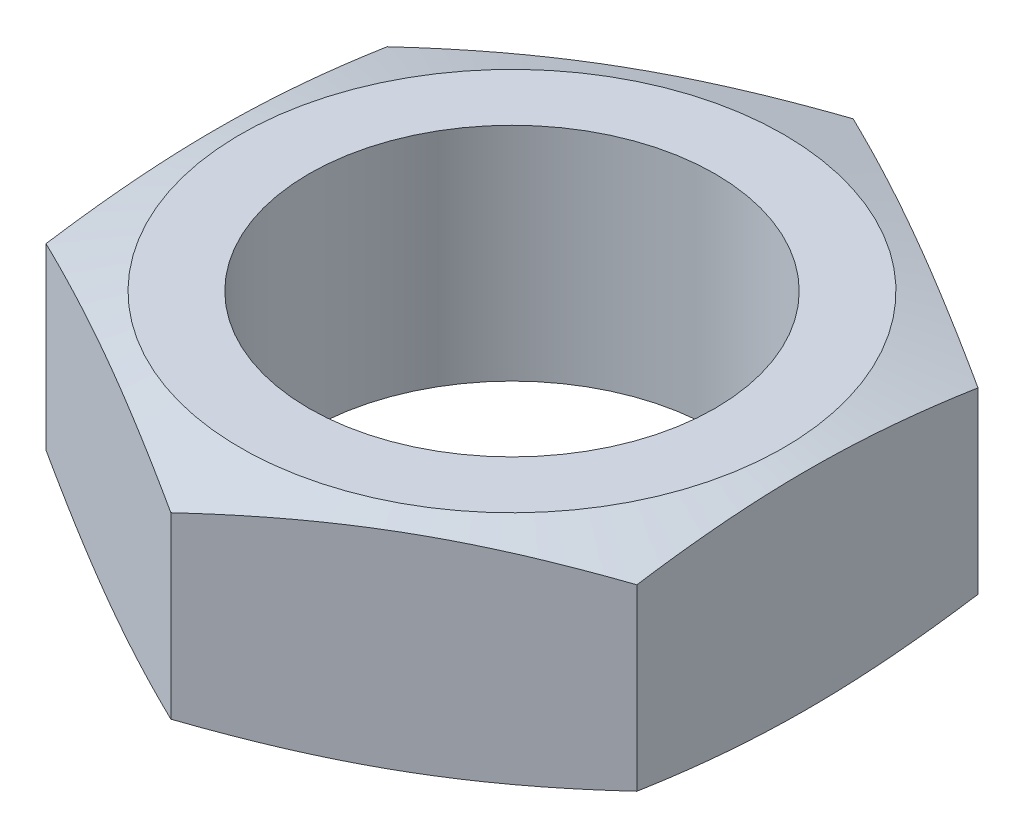
ISO-10303-21;
HEADER;
FILE_DESCRIPTION(('STEP AP214'),'2;1');
FILE_NAME('part.step','',(''),(''),'','','');
FILE_SCHEMA(('AUTOMOTIVE_DESIGN { 1 0 10303 214 1 1 1 1 }'));
ENDSEC;
DATA;
#1=APPLICATION_CONTEXT('core data for automotive mechanical design processes');
#2=APPLICATION_PROTOCOL_DEFINITION('international standard','automotive_design',2000,#1);
#3=PRODUCT_CONTEXT('',#1,'mechanical');
#4=PRODUCT('Part','Part','',(#3));
#5=PRODUCT_RELATED_PRODUCT_CATEGORY('part','',(#4));
#6=PRODUCT_DEFINITION_FORMATION('','',#4);
#7=PRODUCT_DEFINITION_CONTEXT('part definition',#1,'design');
#8=PRODUCT_DEFINITION('design','',#6,#7);
#9=PRODUCT_DEFINITION_SHAPE('','',#8);
#10=(LENGTH_UNIT() NAMED_UNIT(*) SI_UNIT(.MILLI.,.METRE.));
#11=(NAMED_UNIT(*) PLANE_ANGLE_UNIT() SI_UNIT($,.RADIAN.));
#12=(NAMED_UNIT(*) SI_UNIT($,.STERADIAN.) SOLID_ANGLE_UNIT());
#13=UNCERTAINTY_MEASURE_WITH_UNIT(LENGTH_MEASURE(1.E-05),#10,'distance_accuracy_value','');
#14=(GEOMETRIC_REPRESENTATION_CONTEXT(3) GLOBAL_UNCERTAINTY_ASSIGNED_CONTEXT((#13)) GLOBAL_UNIT_ASSIGNED_CONTEXT((#10,
#11,#12)) REPRESENTATION_CONTEXT('',''));
#15=CARTESIAN_POINT('',(0.,0.,0.));
#16=DIRECTION('',(0.,0.,1.));
#17=DIRECTION('',(1.,0.,0.));
#18=AXIS2_PLACEMENT_3D('',#15,#16,#17);
#19=CARTESIAN_POINT('',(0.,0.,0.));
#20=DIRECTION('',(0.,1.,0.));
#21=DIRECTION('',(0.,0.,1.));
#22=AXIS2_PLACEMENT_3D('',#19,#20,#21);
#23=PLANE('',#22);
#24=CARTESIAN_POINT('',(0.,0.,0.));
#25=DIRECTION('',(0.,1.,0.));
#26=DIRECTION('',(0.,0.,1.));
#27=AXIS2_PLACEMENT_3D('',#24,#25,#26);
#28=CIRCLE('',#27,2.1828125);
#29=CARTESIAN_POINT('',(0.,0.,2.1828125));
#30=VERTEX_POINT('',#29);
#31=EDGE_CURVE('E204',#30,#30,#28,.T.);
#32=ORIENTED_EDGE('',*,*,#31,.T.);
#33=EDGE_LOOP('',(#32));
#34=FACE_BOUND('',#33,.T.);
#35=CARTESIAN_POINT('',(0.,0.,0.));
#36=DIRECTION('',(0.,-1.,0.));
#37=DIRECTION('',(0.,0.,-1.));
#38=AXIS2_PLACEMENT_3D('',#35,#36,#37);
#39=CIRCLE('',#38,2.91823842374824);
#40=CARTESIAN_POINT('',(0.,0.,-2.91823842374824));
#41=VERTEX_POINT('',#40);
#42=EDGE_CURVE('E97',#41,#41,#39,.T.);
#43=ORIENTED_EDGE('',*,*,#42,.T.);
#44=EDGE_LOOP('',(#43));
#45=FACE_BOUND('',#44,.T.);
#46=ADVANCED_FACE('F32',(#34,#45),#23,.F.);
#47=CARTESIAN_POINT('',(0.,2.38125,0.));
#48=DIRECTION('',(0.,1.,0.));
#49=DIRECTION('',(0.,0.,1.));
#50=AXIS2_PLACEMENT_3D('',#47,#48,#49);
#51=PLANE('',#50);
#52=CARTESIAN_POINT('',(0.,2.38125,0.));
#53=DIRECTION('',(0.,1.,0.));
#54=DIRECTION('',(0.,0.,1.));
#55=AXIS2_PLACEMENT_3D('',#52,#53,#54);
#56=CIRCLE('',#55,2.1828125);
#57=CARTESIAN_POINT('',(0.,2.38125,2.1828125));
#58=VERTEX_POINT('',#57);
#59=EDGE_CURVE('E205',#58,#58,#56,.T.);
#60=ORIENTED_EDGE('',*,*,#59,.F.);
#61=EDGE_LOOP('',(#60));
#62=FACE_BOUND('',#61,.T.);
#63=CARTESIAN_POINT('',(0.,2.38125,0.));
#64=DIRECTION('',(0.,-1.,0.));
#65=DIRECTION('',(0.,0.,-1.));
#66=AXIS2_PLACEMENT_3D('',#63,#64,#65);
#67=CIRCLE('',#66,2.91823842374824);
#68=CARTESIAN_POINT('',(0.,2.38125,-2.91823842374824));
#69=VERTEX_POINT('',#68);
#70=EDGE_CURVE('E217',#69,#69,#67,.T.);
#71=ORIENTED_EDGE('',*,*,#70,.F.);
#72=EDGE_LOOP('',(#71));
#73=FACE_BOUND('',#72,.T.);
#74=ADVANCED_FACE('F225',(#62,#73),#51,.T.);
#75=CARTESIAN_POINT('',(-3.175,2.38125,1.83308710467706));
#76=DIRECTION('',(0.5,0.,-0.866025403784439));
#77=DIRECTION('',(-0.866025403784439,0.,-0.5));
#78=AXIS2_PLACEMENT_3D('',#75,#76,#77);
#79=PLANE('',#78);
#80=DIRECTION('',(0.,-1.,0.));
#81=VECTOR('',#80,1.);
#82=CARTESIAN_POINT('',(-3.175,2.38125,1.83308710467706));
#83=LINE('',#82,#81);
#84=CARTESIAN_POINT('',(-3.175,2.15147490433856,1.83308710467706));
#85=VERTEX_POINT('',#84);
#86=CARTESIAN_POINT('',(-3.175,0.229775095661449,1.83308710467706));
#87=VERTEX_POINT('',#86);
#88=EDGE_CURVE('E114',#85,#87,#83,.T.);
#89=ORIENTED_EDGE('',*,*,#88,.T.);
#90=CARTESIAN_POINT('',(-3.1752,0.229810571161652,1.83297163462322));
#91=CARTESIAN_POINT('',(-3.04347072029098,0.206435227969929,1.90902556972338));
#92=CARTESIAN_POINT('',(-2.91142913371932,0.185198107402909,1.98525981527476));
#93=CARTESIAN_POINT('',(-2.64673340273103,0.147867080272592,2.13808196681419));
#94=CARTESIAN_POINT('',(-2.51407896526072,0.131775965769645,2.21467004199687));
#95=CARTESIAN_POINT('',(-2.24921175176381,0.105719411660829,2.36759119900882));
#96=CARTESIAN_POINT('',(-2.11700206215993,0.0957132538636206,2.4439224988911));
#97=CARTESIAN_POINT('',(-1.85236153754915,0.0822945636551027,2.59671277701361));
#98=CARTESIAN_POINT('',(-1.71993076877457,0.0788803221892132,2.6731717170146));
#99=CARTESIAN_POINT('',(-1.45506923122543,0.0788803221892132,2.82608959701658));
#100=CARTESIAN_POINT('',(-1.32263846245085,0.0822945636551028,2.90254853701757));
#101=CARTESIAN_POINT('',(-1.05799793784007,0.0957132538636208,3.05533881514009));
#102=CARTESIAN_POINT('',(-0.925788248236195,0.105719411660829,3.13167011502237));
#103=CARTESIAN_POINT('',(-0.660921034739283,0.131775965769646,3.28459127203431));
#104=CARTESIAN_POINT('',(-0.528266597268968,0.147867080272592,3.361179347217));
#105=CARTESIAN_POINT('',(-0.263570866280681,0.18519810740291,3.51400149875643));
#106=CARTESIAN_POINT('',(-0.131529279709024,0.206435227969929,3.5902357443078));
#107=CARTESIAN_POINT('',(0.000199999999999788,0.229810571161653,3.66628967940796));
#108=B_SPLINE_CURVE_WITH_KNOTS('',3,(#90,#91,#92,#93,#94,#95,#96,#97,#98,#99,#100,#101,#102,
#103,#104,#105,#106,#107),.UNSPECIFIED.,.F.,.F.,(4,2,2,2,2,2,2,2,4),(0.,0.461713128028589,
0.923676343673619,1.38251325106804,1.84123118203172,2.2999491129954,2.75878602038983,
3.22074923603486,3.68246236406345),.UNSPECIFIED.);
#109=CARTESIAN_POINT('',(0.,0.22977509566145,3.66617420935412));
#110=VERTEX_POINT('',#109);
#111=EDGE_CURVE('E53',#87,#110,#108,.T.);
#112=ORIENTED_EDGE('',*,*,#111,.T.);
#113=DIRECTION('',(0.,-1.,0.));
#114=VECTOR('',#113,1.);
#115=CARTESIAN_POINT('',(0.,2.38125,3.66617420935412));
#116=LINE('',#115,#114);
#117=CARTESIAN_POINT('',(0.,2.15147490433856,3.66617420935412));
#118=VERTEX_POINT('',#117);
#119=EDGE_CURVE('E120',#118,#110,#116,.T.);
#120=ORIENTED_EDGE('',*,*,#119,.F.);
#121=CARTESIAN_POINT('',(0.000199999999999305,2.15143942883835,3.66628967940796));
#122=CARTESIAN_POINT('',(-0.131529279709024,2.17481477203008,3.5902357443078));
#123=CARTESIAN_POINT('',(-0.263570866280681,2.19605189259709,3.51400149875643));
#124=CARTESIAN_POINT('',(-0.528266597268968,2.23338291972741,3.361179347217));
#125=CARTESIAN_POINT('',(-0.660921034739283,2.24947403423036,3.28459127203431));
#126=CARTESIAN_POINT('',(-0.925788248236195,2.27553058833917,3.13167011502237));
#127=CARTESIAN_POINT('',(-1.05799793784007,2.28553674613638,3.05533881514009));
#128=CARTESIAN_POINT('',(-1.32263846245085,2.2989554363449,2.90254853701757));
#129=CARTESIAN_POINT('',(-1.45506923122543,2.30236967781079,2.82608959701658));
#130=CARTESIAN_POINT('',(-1.71993076877458,2.30236967781079,2.6731717170146));
#131=CARTESIAN_POINT('',(-1.85236153754915,2.2989554363449,2.59671277701361));
#132=CARTESIAN_POINT('',(-2.11700206215993,2.28553674613638,2.4439224988911));
#133=CARTESIAN_POINT('',(-2.24921175176381,2.27553058833917,2.36759119900882));
#134=CARTESIAN_POINT('',(-2.51407896526072,2.24947403423036,2.21467004199687));
#135=CARTESIAN_POINT('',(-2.64673340273103,2.23338291972741,2.13808196681419));
#136=CARTESIAN_POINT('',(-2.91142913371932,2.19605189259709,1.98525981527476));
#137=CARTESIAN_POINT('',(-3.04347072029098,2.17481477203008,1.90902556972338));
#138=CARTESIAN_POINT('',(-3.1752,2.15143942883835,1.83297163462322));
#139=B_SPLINE_CURVE_WITH_KNOTS('',3,(#121,#122,#123,#124,#125,#126,#127,#128,#129,#130,#131,
#132,#133,#134,#135,#136,#137,#138),.UNSPECIFIED.,.F.,.F.,(4,2,2,2,2,2,2,2,4),(0.,
0.46171312802859,0.923676343673619,1.38251325106804,1.84123118203172,2.2999491129954,
2.75878602038983,3.22074923603486,3.68246236406345),.UNSPECIFIED.);
#140=EDGE_CURVE('E194',#118,#85,#139,.T.);
#141=ORIENTED_EDGE('',*,*,#140,.T.);
#142=EDGE_LOOP('',(#89,#112,#120,#141));
#143=FACE_BOUND('',#142,.T.);
#144=ADVANCED_FACE('F34',(#143),#79,.F.);
#145=CARTESIAN_POINT('',(0.,2.38125,3.66617420935412));
#146=DIRECTION('',(-0.5,0.,-0.866025403784439));
#147=DIRECTION('',(-0.866025403784439,0.,0.5));
#148=AXIS2_PLACEMENT_3D('',#145,#146,#147);
#149=PLANE('',#148);
#150=ORIENTED_EDGE('',*,*,#119,.T.);
#151=CARTESIAN_POINT('',(-0.000200000000000749,0.229810571161653,3.66628967940796));
#152=CARTESIAN_POINT('',(0.131529279709023,0.206435227969929,3.5902357443078));
#153=CARTESIAN_POINT('',(0.26357086628068,0.18519810740291,3.51400149875643));
#154=CARTESIAN_POINT('',(0.528266597268967,0.147867080272592,3.361179347217));
#155=CARTESIAN_POINT('',(0.660921034739282,0.131775965769645,3.28459127203431));
#156=CARTESIAN_POINT('',(0.925788248236194,0.105719411660829,3.13167011502237));
#157=CARTESIAN_POINT('',(1.05799793784007,0.0957132538636205,3.05533881514009));
#158=CARTESIAN_POINT('',(1.32263846245085,0.0822945636551026,2.90254853701757));
#159=CARTESIAN_POINT('',(1.45506923122543,0.078880322189213,2.82608959701658));
#160=CARTESIAN_POINT('',(1.71993076877457,0.0788803221892129,2.6731717170146));
#161=CARTESIAN_POINT('',(1.85236153754915,0.0822945636551025,2.59671277701361));
#162=CARTESIAN_POINT('',(2.11700206215993,0.0957132538636203,2.44392249889109));
#163=CARTESIAN_POINT('',(2.24921175176381,0.105719411660829,2.36759119900882));
#164=CARTESIAN_POINT('',(2.51407896526072,0.131775965769645,2.21467004199687));
#165=CARTESIAN_POINT('',(2.64673340273103,0.147867080272592,2.13808196681419));
#166=CARTESIAN_POINT('',(2.91142913371932,0.185198107402909,1.98525981527475));
#167=CARTESIAN_POINT('',(3.04347072029098,0.206435227969928,1.90902556972338));
#168=CARTESIAN_POINT('',(3.1752,0.229810571161652,1.83297163462322));
#169=B_SPLINE_CURVE_WITH_KNOTS('',3,(#151,#152,#153,#154,#155,#156,#157,#158,#159,#160,#161,
#162,#163,#164,#165,#166,#167,#168),.UNSPECIFIED.,.F.,.F.,(4,2,2,2,2,2,2,2,4),(0.,
0.46171312802859,0.92367634367362,1.38251325106805,1.84123118203172,2.2999491129954,
2.75878602038983,3.22074923603486,3.68246236406345),.UNSPECIFIED.);
#170=CARTESIAN_POINT('',(3.175,0.229775095661449,1.83308710467706));
#171=VERTEX_POINT('',#170);
#172=EDGE_CURVE('E171',#110,#171,#169,.T.);
#173=ORIENTED_EDGE('',*,*,#172,.T.);
#174=DIRECTION('',(0.,-1.,0.));
#175=VECTOR('',#174,1.);
#176=CARTESIAN_POINT('',(3.175,2.38125,1.83308710467706));
#177=LINE('',#176,#175);
#178=CARTESIAN_POINT('',(3.175,2.15147490433856,1.83308710467706));
#179=VERTEX_POINT('',#178);
#180=EDGE_CURVE('E112',#179,#171,#177,.T.);
#181=ORIENTED_EDGE('',*,*,#180,.F.);
#182=CARTESIAN_POINT('',(3.1752,2.15143942883835,1.83297163462322));
#183=CARTESIAN_POINT('',(3.04347072029098,2.17481477203008,1.90902556972338));
#184=CARTESIAN_POINT('',(2.91142913371932,2.19605189259709,1.98525981527475));
#185=CARTESIAN_POINT('',(2.64673340273103,2.23338291972741,2.13808196681419));
#186=CARTESIAN_POINT('',(2.51407896526072,2.24947403423036,2.21467004199687));
#187=CARTESIAN_POINT('',(2.24921175176381,2.27553058833917,2.36759119900882));
#188=CARTESIAN_POINT('',(2.11700206215993,2.28553674613638,2.44392249889109));
#189=CARTESIAN_POINT('',(1.85236153754915,2.2989554363449,2.59671277701361));
#190=CARTESIAN_POINT('',(1.71993076877457,2.30236967781079,2.6731717170146));
#191=CARTESIAN_POINT('',(1.45506923122543,2.30236967781079,2.82608959701658));
#192=CARTESIAN_POINT('',(1.32263846245085,2.2989554363449,2.90254853701757));
#193=CARTESIAN_POINT('',(1.05799793784007,2.28553674613638,3.05533881514009));
#194=CARTESIAN_POINT('',(0.925788248236195,2.27553058833917,3.13167011502237));
#195=CARTESIAN_POINT('',(0.660921034739283,2.24947403423036,3.28459127203431));
#196=CARTESIAN_POINT('',(0.528266597268967,2.23338291972741,3.361179347217));
#197=CARTESIAN_POINT('',(0.26357086628068,2.19605189259709,3.51400149875643));
#198=CARTESIAN_POINT('',(0.131529279709024,2.17481477203008,3.5902357443078));
#199=CARTESIAN_POINT('',(-0.000199999999999806,2.15143942883835,3.66628967940796));
#200=B_SPLINE_CURVE_WITH_KNOTS('',3,(#182,#183,#184,#185,#186,#187,#188,#189,#190,#191,#192,
#193,#194,#195,#196,#197,#198,#199),.UNSPECIFIED.,.F.,.F.,(4,2,2,2,2,2,2,2,4),(0.,
0.46171312802859,0.923676343673619,1.38251325106804,1.84123118203172,2.2999491129954,
2.75878602038983,3.22074923603486,3.68246236406345),.UNSPECIFIED.);
#201=EDGE_CURVE('E187',#179,#118,#200,.T.);
#202=ORIENTED_EDGE('',*,*,#201,.T.);
#203=EDGE_LOOP('',(#150,#173,#181,#202));
#204=FACE_BOUND('',#203,.T.);
#205=ADVANCED_FACE('F179',(#204),#149,.F.);
#206=CARTESIAN_POINT('',(3.175,2.38125,1.83308710467706));
#207=DIRECTION('',(-1.,0.,0.));
#208=DIRECTION('',(0.,0.,1.));
#209=AXIS2_PLACEMENT_3D('',#206,#207,#208);
#210=PLANE('',#209);
#211=ORIENTED_EDGE('',*,*,#180,.T.);
#212=CARTESIAN_POINT('',(3.175,0.882498028858926,-4.84284838209254));
#213=CARTESIAN_POINT('',(3.175,0.845540450956629,-4.69896045540046));
#214=CARTESIAN_POINT('',(3.175,0.809028709215445,-4.55495598894786));
#215=CARTESIAN_POINT('',(3.175,0.73713997881131,-4.26665584852569));
#216=CARTESIAN_POINT('',(3.175,0.701763053935023,-4.12236015866968));
#217=CARTESIAN_POINT('',(3.175,0.632346095802565,-3.83324755787578));
#218=CARTESIAN_POINT('',(3.175,0.598307862474974,-3.68843021298746));
#219=CARTESIAN_POINT('',(3.175,0.531949077929729,-3.39840339671895));
#220=CARTESIAN_POINT('',(3.175,0.499628507893863,-3.25319392965305));
#221=CARTESIAN_POINT('',(3.175,0.437454196156556,-2.96387089117817));
#222=CARTESIAN_POINT('',(3.175,0.407577727683183,-2.81976225514172));
#223=CARTESIAN_POINT('',(3.175,0.350421882488817,-2.53103214177129));
#224=CARTESIAN_POINT('',(3.175,0.323142585134038,-2.38641064890505));
#225=CARTESIAN_POINT('',(3.175,0.246115500745554,-1.95171977178272));
#226=CARTESIAN_POINT('',(3.175,0.201160252258429,-1.66074213267588));
#227=CARTESIAN_POINT('',(3.175,0.147610508501762,-1.22030766375216));
#228=CARTESIAN_POINT('',(3.175,0.132010907382333,-1.07170073881368));
#229=CARTESIAN_POINT('',(3.175,0.106484281846803,-0.773993441648314));
#230=CARTESIAN_POINT('',(3.175,0.0965570727412833,-0.624893085646215));
#231=CARTESIAN_POINT('',(3.175,0.0829772445358877,-0.326493153784527));
#232=CARTESIAN_POINT('',(3.175,0.0793207849923239,-0.177193755942888));
#233=CARTESIAN_POINT('',(3.175,0.0785150973855896,0.121423152153427));
#234=CARTESIAN_POINT('',(3.175,0.0813658685575196,0.270740662405972));
#235=CARTESIAN_POINT('',(3.175,0.0934120979065997,0.569828401407168));
#236=CARTESIAN_POINT('',(3.175,0.102637791930309,0.71959738658901));
#237=CARTESIAN_POINT('',(3.175,0.126894565315699,1.01867337403518));
#238=CARTESIAN_POINT('',(3.175,0.141926340101328,1.16798031879835));
#239=CARTESIAN_POINT('',(3.175,0.177017570955498,1.46612406986226));
#240=CARTESIAN_POINT('',(3.175,0.197081365135513,1.6149603577177));
#241=CARTESIAN_POINT('',(3.175,0.241391749068005,1.91199750936059));
#242=CARTESIAN_POINT('',(3.175,0.265638258320237,2.06019838532089));
#243=CARTESIAN_POINT('',(3.175,0.339809615735374,2.48313370046352));
#244=CARTESIAN_POINT('',(3.175,0.393892302381207,2.7571352022586));
#245=CARTESIAN_POINT('',(3.175,0.509788370688865,3.3034975349043));
#246=CARTESIAN_POINT('',(3.175,0.571602977553403,3.57585809854592));
#247=CARTESIAN_POINT('',(3.175,0.700401117934673,4.11940090365494));
#248=CARTESIAN_POINT('',(3.175,0.767385649905057,4.39058290677428));
#249=CARTESIAN_POINT('',(3.175,0.904872680248803,4.93205405050345));
#250=CARTESIAN_POINT('',(3.175,0.975375268587398,5.2023431680914));
#251=CARTESIAN_POINT('',(3.175,1.11790589811358,5.73871832141435));
#252=CARTESIAN_POINT('',(3.175,1.18990175033281,6.00481294202591));
#253=CARTESIAN_POINT('',(3.175,1.33563742671576,6.53652945843044));
#254=CARTESIAN_POINT('',(3.175,1.40937729077384,6.80215134325982));
#255=CARTESIAN_POINT('',(3.175,1.5580369658754,7.3326419919057));
#256=CARTESIAN_POINT('',(3.175,1.63295487879459,7.59751128874055));
#257=CARTESIAN_POINT('',(3.175,1.78378297635461,8.12695565512506));
#258=CARTESIAN_POINT('',(3.175,1.85969312015137,8.39153073630235));
#259=CARTESIAN_POINT('',(3.175,1.93595574595595,8.65600298411708));
#260=B_SPLINE_CURVE_WITH_KNOTS('',3,(#212,#213,#214,#215,#216,#217,#218,#219,#220,#221,#222,
#223,#224,#225,#226,#227,#228,#229,#230,#231,#232,#233,#234,#235,#236,#237,#238,#239,#240,#241,
#242,#243,#244,#245,#246,#247,#248,#249,#250,#251,#252,#253,#254,#255,#256,#257,#258,#259),
.UNSPECIFIED.,.F.,.F.,(4,2,2,2,2,2,2,2,2,2,2,2,2,2,2,2,2,2,2,2,2,2,2,4),(0.,0.445677382769421,
0.891379772777596,1.33766225663657,1.78393985014783,2.22543420311392,2.66694204325312,
3.54970624815682,3.99788889099381,4.44605694046202,4.89395041675473,5.34184384039931,
5.79187630718249,6.24196269337618,6.6924384415769,7.14290552091956,7.98057217990627,
8.81837174439543,9.65633351768017,10.4943167306723,11.3212958977876,12.1482940004242,
12.9740738952841,13.7998199042316),.UNSPECIFIED.);
#261=CARTESIAN_POINT('',(3.175,0.229775095661447,-1.83308710467706));
#262=VERTEX_POINT('',#261);
#263=EDGE_CURVE('E107',#171,#262,#260,.F.);
#264=ORIENTED_EDGE('',*,*,#263,.T.);
#265=DIRECTION('',(0.,-1.,0.));
#266=VECTOR('',#265,1.);
#267=CARTESIAN_POINT('',(3.175,2.38125,-1.83308710467706));
#268=LINE('',#267,#266);
#269=CARTESIAN_POINT('',(3.175,2.15147490433855,-1.83308710467706));
#270=VERTEX_POINT('',#269);
#271=EDGE_CURVE('E106',#270,#262,#268,.T.);
#272=ORIENTED_EDGE('',*,*,#271,.F.);
#273=CARTESIAN_POINT('',(3.175,1.49875197114108,-4.84284838209254));
#274=CARTESIAN_POINT('',(3.175,1.53570954904337,-4.69896045540046));
#275=CARTESIAN_POINT('',(3.175,1.57222129078456,-4.55495598894786));
#276=CARTESIAN_POINT('',(3.175,1.64411002118869,-4.26665584852569));
#277=CARTESIAN_POINT('',(3.175,1.67948694606498,-4.12236015866968));
#278=CARTESIAN_POINT('',(3.175,1.74890390419744,-3.83324755787577));
#279=CARTESIAN_POINT('',(3.175,1.78294213752503,-3.68843021298746));
#280=CARTESIAN_POINT('',(3.175,1.84930092207027,-3.39840339671895));
#281=CARTESIAN_POINT('',(3.175,1.88162149210614,-3.25319392965304));
#282=CARTESIAN_POINT('',(3.175,1.94379580384345,-2.96387089117817));
#283=CARTESIAN_POINT('',(3.175,1.97367227231682,-2.81976225514172));
#284=CARTESIAN_POINT('',(3.175,2.03082811751118,-2.53103214177129));
#285=CARTESIAN_POINT('',(3.175,2.05810741486596,-2.38641064890505));
#286=CARTESIAN_POINT('',(3.175,2.13513449925445,-1.95171977178272));
#287=CARTESIAN_POINT('',(3.175,2.18008974774157,-1.66074213267588));
#288=CARTESIAN_POINT('',(3.175,2.23363949149824,-1.22030766375216));
#289=CARTESIAN_POINT('',(3.175,2.24923909261767,-1.07170073881368));
#290=CARTESIAN_POINT('',(3.175,2.2747657181532,-0.773993441648314));
#291=CARTESIAN_POINT('',(3.175,2.28469292725872,-0.624893085646215));
#292=CARTESIAN_POINT('',(3.175,2.29827275546411,-0.326493153784528));
#293=CARTESIAN_POINT('',(3.175,2.30192921500768,-0.17719375594289));
#294=CARTESIAN_POINT('',(3.175,2.30273490261441,0.121423152153425));
#295=CARTESIAN_POINT('',(3.175,2.29988413144248,0.270740662405971));
#296=CARTESIAN_POINT('',(3.175,2.2878379020934,0.569828401407167));
#297=CARTESIAN_POINT('',(3.175,2.27861220806969,0.719597386589008));
#298=CARTESIAN_POINT('',(3.175,2.2543554346843,1.01867337403517));
#299=CARTESIAN_POINT('',(3.175,2.23932365989867,1.16798031879835));
#300=CARTESIAN_POINT('',(3.175,2.20423242904451,1.46612406986226));
#301=CARTESIAN_POINT('',(3.175,2.18416863486449,1.6149603577177));
#302=CARTESIAN_POINT('',(3.175,2.139858250932,1.91199750936059));
#303=CARTESIAN_POINT('',(3.175,2.11561174167977,2.06019838532089));
#304=CARTESIAN_POINT('',(3.175,2.04144038426463,2.48313370046352));
#305=CARTESIAN_POINT('',(3.175,1.9873576976188,2.7571352022586));
#306=CARTESIAN_POINT('',(3.175,1.87146162931114,3.3034975349043));
#307=CARTESIAN_POINT('',(3.175,1.8096470224466,3.57585809854592));
#308=CARTESIAN_POINT('',(3.175,1.68084888206533,4.11940090365494));
#309=CARTESIAN_POINT('',(3.175,1.61386435009495,4.39058290677428));
#310=CARTESIAN_POINT('',(3.175,1.4763773197512,4.93205405050346));
#311=CARTESIAN_POINT('',(3.175,1.40587473141261,5.2023431680914));
#312=CARTESIAN_POINT('',(3.175,1.26334410188643,5.73871832141435));
#313=CARTESIAN_POINT('',(3.175,1.1913482496672,6.00481294202591));
#314=CARTESIAN_POINT('',(3.175,1.04561257328425,6.53652945843044));
#315=CARTESIAN_POINT('',(3.175,0.971872709226169,6.80215134325982));
#316=CARTESIAN_POINT('',(3.175,0.823213034124614,7.3326419919057));
#317=CARTESIAN_POINT('',(3.175,0.748295121205423,7.59751128874055));
#318=CARTESIAN_POINT('',(3.175,0.597467023645403,8.12695565512506));
#319=CARTESIAN_POINT('',(3.175,0.521556879848638,8.39153073630235));
#320=CARTESIAN_POINT('',(3.175,0.445294254044064,8.65600298411708));
#321=B_SPLINE_CURVE_WITH_KNOTS('',3,(#273,#274,#275,#276,#277,#278,#279,#280,#281,#282,#283,
#284,#285,#286,#287,#288,#289,#290,#291,#292,#293,#294,#295,#296,#297,#298,#299,#300,#301,#302,
#303,#304,#305,#306,#307,#308,#309,#310,#311,#312,#313,#314,#315,#316,#317,#318,#319,#320),
.UNSPECIFIED.,.F.,.F.,(4,2,2,2,2,2,2,2,2,2,2,2,2,2,2,2,2,2,2,2,2,2,2,4),(0.,0.445677382769421,
0.891379772777597,1.33766225663658,1.78393985014783,2.22543420311392,2.66694204325312,
3.54970624815682,3.99788889099381,4.44605694046202,4.89395041675472,5.34184384039931,
5.79187630718249,6.24196269337618,6.6924384415769,7.14290552091955,7.98057217990627,
8.81837174439542,9.65633351768017,10.4943167306723,11.3212958977876,12.1482940004242,
12.9740738952841,13.7998199042316),.UNSPECIFIED.);
#322=EDGE_CURVE('E195',#270,#179,#321,.T.);
#323=ORIENTED_EDGE('',*,*,#322,.T.);
#324=EDGE_LOOP('',(#211,#264,#272,#323));
#325=FACE_BOUND('',#324,.T.);
#326=ADVANCED_FACE('F182',(#325),#210,.F.);
#327=CARTESIAN_POINT('',(3.175,2.38125,-1.83308710467706));
#328=DIRECTION('',(-0.5,0.,0.866025403784439));
#329=DIRECTION('',(0.866025403784439,0.,0.5));
#330=AXIS2_PLACEMENT_3D('',#327,#328,#329);
#331=PLANE('',#330);
#332=ORIENTED_EDGE('',*,*,#271,.T.);
#333=CARTESIAN_POINT('',(3.1752,0.229810571161651,-1.83297163462322));
#334=CARTESIAN_POINT('',(3.04347072029098,0.206435227969927,-1.90902556972338));
#335=CARTESIAN_POINT('',(2.91142913371932,0.185198107402908,-1.98525981527476));
#336=CARTESIAN_POINT('',(2.64673340273103,0.14786708027259,-2.13808196681419));
#337=CARTESIAN_POINT('',(2.51407896526072,0.131775965769643,-2.21467004199687));
#338=CARTESIAN_POINT('',(2.24921175176381,0.105719411660827,-2.36759119900882));
#339=CARTESIAN_POINT('',(2.11700206215993,0.0957132538636186,-2.4439224988911));
#340=CARTESIAN_POINT('',(1.85236153754915,0.0822945636551006,-2.59671277701361));
#341=CARTESIAN_POINT('',(1.71993076877457,0.0788803221892111,-2.6731717170146));
#342=CARTESIAN_POINT('',(1.45506923122543,0.0788803221892111,-2.82608959701658));
#343=CARTESIAN_POINT('',(1.32263846245085,0.0822945636551007,-2.90254853701757));
#344=CARTESIAN_POINT('',(1.05799793784007,0.0957132538636185,-3.05533881514009));
#345=CARTESIAN_POINT('',(0.925788248236194,0.105719411660827,-3.13167011502237));
#346=CARTESIAN_POINT('',(0.660921034739282,0.131775965769643,-3.28459127203431));
#347=CARTESIAN_POINT('',(0.528266597268966,0.14786708027259,-3.361179347217));
#348=CARTESIAN_POINT('',(0.26357086628068,0.185198107402907,-3.51400149875643));
#349=CARTESIAN_POINT('',(0.131529279709023,0.206435227969927,-3.5902357443078));
#350=CARTESIAN_POINT('',(-0.000200000000000284,0.22981057116165,-3.66628967940796));
#351=B_SPLINE_CURVE_WITH_KNOTS('',3,(#333,#334,#335,#336,#337,#338,#339,#340,#341,#342,#343,
#344,#345,#346,#347,#348,#349,#350),.UNSPECIFIED.,.F.,.F.,(4,2,2,2,2,2,2,2,4),(0.,
0.46171312802859,0.923676343673619,1.38251325106804,1.84123118203172,2.2999491129954,
2.75878602038983,3.22074923603486,3.68246236406345),.UNSPECIFIED.);
#352=CARTESIAN_POINT('',(0.,0.229775095661447,-3.66617420935412));
#353=VERTEX_POINT('',#352);
#354=EDGE_CURVE('E91',#262,#353,#351,.T.);
#355=ORIENTED_EDGE('',*,*,#354,.T.);
#356=DIRECTION('',(0.,-1.,0.));
#357=VECTOR('',#356,1.);
#358=CARTESIAN_POINT('',(0.,2.38125,-3.66617420935412));
#359=LINE('',#358,#357);
#360=CARTESIAN_POINT('',(0.,2.15147490433855,-3.66617420935412));
#361=VERTEX_POINT('',#360);
#362=EDGE_CURVE('E104',#361,#353,#359,.T.);
#363=ORIENTED_EDGE('',*,*,#362,.F.);
#364=CARTESIAN_POINT('',(-0.000199999999999995,2.15143942883835,-3.66628967940796));
#365=CARTESIAN_POINT('',(0.131529279709023,2.17481477203007,-3.5902357443078));
#366=CARTESIAN_POINT('',(0.26357086628068,2.19605189259709,-3.51400149875643));
#367=CARTESIAN_POINT('',(0.528266597268967,2.23338291972741,-3.361179347217));
#368=CARTESIAN_POINT('',(0.660921034739282,2.24947403423036,-3.28459127203431));
#369=CARTESIAN_POINT('',(0.925788248236194,2.27553058833917,-3.13167011502237));
#370=CARTESIAN_POINT('',(1.05799793784007,2.28553674613638,-3.05533881514009));
#371=CARTESIAN_POINT('',(1.32263846245085,2.2989554363449,-2.90254853701757));
#372=CARTESIAN_POINT('',(1.45506923122543,2.30236967781079,-2.82608959701658));
#373=CARTESIAN_POINT('',(1.71993076877457,2.30236967781079,-2.6731717170146));
#374=CARTESIAN_POINT('',(1.85236153754915,2.2989554363449,-2.59671277701361));
#375=CARTESIAN_POINT('',(2.11700206215993,2.28553674613638,-2.4439224988911));
#376=CARTESIAN_POINT('',(2.24921175176381,2.27553058833917,-2.36759119900882));
#377=CARTESIAN_POINT('',(2.51407896526072,2.24947403423036,-2.21467004199687));
#378=CARTESIAN_POINT('',(2.64673340273103,2.23338291972741,-2.13808196681419));
#379=CARTESIAN_POINT('',(2.91142913371932,2.19605189259709,-1.98525981527476));
#380=CARTESIAN_POINT('',(3.04347072029098,2.17481477203007,-1.90902556972338));
#381=CARTESIAN_POINT('',(3.1752,2.15143942883835,-1.83297163462322));
#382=B_SPLINE_CURVE_WITH_KNOTS('',3,(#364,#365,#366,#367,#368,#369,#370,#371,#372,#373,#374,
#375,#376,#377,#378,#379,#380,#381),.UNSPECIFIED.,.F.,.F.,(4,2,2,2,2,2,2,2,4),(0.,
0.461713128028589,0.923676343673618,1.38251325106804,1.84123118203172,2.2999491129954,
2.75878602038983,3.22074923603486,3.68246236406345),.UNSPECIFIED.);
#383=EDGE_CURVE('E216',#361,#270,#382,.T.);
#384=ORIENTED_EDGE('',*,*,#383,.T.);
#385=EDGE_LOOP('',(#332,#355,#363,#384));
#386=FACE_BOUND('',#385,.T.);
#387=ADVANCED_FACE('F102',(#386),#331,.F.);
#388=CARTESIAN_POINT('',(0.,2.38125,-3.66617420935412));
#389=DIRECTION('',(0.5,0.,0.866025403784439));
#390=DIRECTION('',(0.866025403784439,0.,-0.5));
#391=AXIS2_PLACEMENT_3D('',#388,#389,#390);
#392=PLANE('',#391);
#393=ORIENTED_EDGE('',*,*,#362,.T.);
#394=CARTESIAN_POINT('',(0.000200000000000058,0.22981057116165,-3.66628967940796));
#395=CARTESIAN_POINT('',(-0.131529279709024,0.206435227969926,-3.5902357443078));
#396=CARTESIAN_POINT('',(-0.263570866280681,0.185198107402907,-3.51400149875643));
#397=CARTESIAN_POINT('',(-0.528266597268967,0.14786708027259,-3.361179347217));
#398=CARTESIAN_POINT('',(-0.660921034739282,0.131775965769643,-3.28459127203431));
#399=CARTESIAN_POINT('',(-0.925788248236194,0.105719411660827,-3.13167011502237));
#400=CARTESIAN_POINT('',(-1.05799793784007,0.0957132538636186,-3.05533881514009));
#401=CARTESIAN_POINT('',(-1.32263846245085,0.0822945636551007,-2.90254853701757));
#402=CARTESIAN_POINT('',(-1.45506923122543,0.0788803221892111,-2.82608959701658));
#403=CARTESIAN_POINT('',(-1.71993076877457,0.078880322189211,-2.6731717170146));
#404=CARTESIAN_POINT('',(-1.85236153754915,0.0822945636551006,-2.59671277701361));
#405=CARTESIAN_POINT('',(-2.11700206215993,0.0957132538636187,-2.4439224988911));
#406=CARTESIAN_POINT('',(-2.24921175176381,0.105719411660827,-2.36759119900882));
#407=CARTESIAN_POINT('',(-2.51407896526072,0.131775965769644,-2.21467004199687));
#408=CARTESIAN_POINT('',(-2.64673340273103,0.14786708027259,-2.13808196681419));
#409=CARTESIAN_POINT('',(-2.91142913371932,0.185198107402908,-1.98525981527476));
#410=CARTESIAN_POINT('',(-3.04347072029098,0.206435227969927,-1.90902556972338));
#411=CARTESIAN_POINT('',(-3.1752,0.229810571161651,-1.83297163462322));
#412=B_SPLINE_CURVE_WITH_KNOTS('',3,(#394,#395,#396,#397,#398,#399,#400,#401,#402,#403,#404,
#405,#406,#407,#408,#409,#410,#411),.UNSPECIFIED.,.F.,.F.,(4,2,2,2,2,2,2,2,4),(0.,
0.46171312802859,0.923676343673619,1.38251325106804,1.84123118203172,2.2999491129954,
2.75878602038983,3.22074923603486,3.68246236406345),.UNSPECIFIED.);
#413=CARTESIAN_POINT('',(-3.175,0.229775095661447,-1.83308710467706));
#414=VERTEX_POINT('',#413);
#415=EDGE_CURVE('E88',#353,#414,#412,.T.);
#416=ORIENTED_EDGE('',*,*,#415,.T.);
#417=DIRECTION('',(0.,-1.,0.));
#418=VECTOR('',#417,1.);
#419=CARTESIAN_POINT('',(-3.175,2.38125,-1.83308710467706));
#420=LINE('',#419,#418);
#421=CARTESIAN_POINT('',(-3.175,2.15147490433855,-1.83308710467706));
#422=VERTEX_POINT('',#421);
#423=EDGE_CURVE('E110',#422,#414,#420,.T.);
#424=ORIENTED_EDGE('',*,*,#423,.F.);
#425=CARTESIAN_POINT('',(-3.1752,2.15143942883835,-1.83297163462322));
#426=CARTESIAN_POINT('',(-3.04347072029098,2.17481477203007,-1.90902556972338));
#427=CARTESIAN_POINT('',(-2.91142913371932,2.19605189259709,-1.98525981527476));
#428=CARTESIAN_POINT('',(-2.64673340273103,2.23338291972741,-2.13808196681419));
#429=CARTESIAN_POINT('',(-2.51407896526072,2.24947403423036,-2.21467004199687));
#430=CARTESIAN_POINT('',(-2.24921175176381,2.27553058833917,-2.36759119900882));
#431=CARTESIAN_POINT('',(-2.11700206215993,2.28553674613638,-2.4439224988911));
#432=CARTESIAN_POINT('',(-1.85236153754915,2.2989554363449,-2.59671277701361));
#433=CARTESIAN_POINT('',(-1.71993076877457,2.30236967781079,-2.6731717170146));
#434=CARTESIAN_POINT('',(-1.45506923122543,2.30236967781079,-2.82608959701658));
#435=CARTESIAN_POINT('',(-1.32263846245085,2.2989554363449,-2.90254853701757));
#436=CARTESIAN_POINT('',(-1.05799793784007,2.28553674613638,-3.05533881514009));
#437=CARTESIAN_POINT('',(-0.925788248236194,2.27553058833917,-3.13167011502237));
#438=CARTESIAN_POINT('',(-0.660921034739282,2.24947403423036,-3.28459127203431));
#439=CARTESIAN_POINT('',(-0.528266597268967,2.23338291972741,-3.361179347217));
#440=CARTESIAN_POINT('',(-0.26357086628068,2.19605189259709,-3.51400149875643));
#441=CARTESIAN_POINT('',(-0.131529279709023,2.17481477203007,-3.5902357443078));
#442=CARTESIAN_POINT('',(0.000200000000000677,2.15143942883835,-3.66628967940796));
#443=B_SPLINE_CURVE_WITH_KNOTS('',3,(#425,#426,#427,#428,#429,#430,#431,#432,#433,#434,#435,
#436,#437,#438,#439,#440,#441,#442),.UNSPECIFIED.,.F.,.F.,(4,2,2,2,2,2,2,2,4),(0.,
0.461713128028589,0.923676343673618,1.38251325106804,1.84123118203172,2.2999491129954,
2.75878602038983,3.22074923603486,3.68246236406345),.UNSPECIFIED.);
#444=EDGE_CURVE('E60',#422,#361,#443,.T.);
#445=ORIENTED_EDGE('',*,*,#444,.T.);
#446=EDGE_LOOP('',(#393,#416,#424,#445));
#447=FACE_BOUND('',#446,.T.);
#448=ADVANCED_FACE('F109',(#447),#392,.F.);
#449=CARTESIAN_POINT('',(-3.175,2.38125,-1.83308710467706));
#450=DIRECTION('',(1.,0.,0.));
#451=DIRECTION('',(0.,0.,-1.));
#452=AXIS2_PLACEMENT_3D('',#449,#450,#451);
#453=PLANE('',#452);
#454=ORIENTED_EDGE('',*,*,#423,.T.);
#455=CARTESIAN_POINT('',(-3.175,0.882498028858926,-4.84284838209254));
#456=CARTESIAN_POINT('',(-3.175,0.845540450956629,-4.69896045540046));
#457=CARTESIAN_POINT('',(-3.175,0.809028709215445,-4.55495598894786));
#458=CARTESIAN_POINT('',(-3.175,0.73713997881131,-4.26665584852569));
#459=CARTESIAN_POINT('',(-3.175,0.701763053935023,-4.12236015866968));
#460=CARTESIAN_POINT('',(-3.175,0.632346095802565,-3.83324755787577));
#461=CARTESIAN_POINT('',(-3.175,0.598307862474975,-3.68843021298746));
#462=CARTESIAN_POINT('',(-3.175,0.53194907792973,-3.39840339671895));
#463=CARTESIAN_POINT('',(-3.175,0.499628507893863,-3.25319392965305));
#464=CARTESIAN_POINT('',(-3.175,0.437454196156556,-2.96387089117817));
#465=CARTESIAN_POINT('',(-3.175,0.407577727683184,-2.81976225514172));
#466=CARTESIAN_POINT('',(-3.175,0.350421882488817,-2.53103214177129));
#467=CARTESIAN_POINT('',(-3.175,0.323142585134038,-2.38641064890505));
#468=CARTESIAN_POINT('',(-3.175,0.246115500745554,-1.95171977178272));
#469=CARTESIAN_POINT('',(-3.175,0.201160252258429,-1.66074213267588));
#470=CARTESIAN_POINT('',(-3.175,0.147610508501762,-1.22030766375216));
#471=CARTESIAN_POINT('',(-3.175,0.132010907382334,-1.07170073881368));
#472=CARTESIAN_POINT('',(-3.175,0.106484281846803,-0.773993441648313));
#473=CARTESIAN_POINT('',(-3.175,0.0965570727412835,-0.624893085646214));
#474=CARTESIAN_POINT('',(-3.175,0.0829772445358878,-0.326493153784527));
#475=CARTESIAN_POINT('',(-3.175,0.079320784992324,-0.177193755942888));
#476=CARTESIAN_POINT('',(-3.175,0.0785150973855898,0.121423152153427));
#477=CARTESIAN_POINT('',(-3.175,0.0813658685575198,0.270740662405973));
#478=CARTESIAN_POINT('',(-3.175,0.0934120979065999,0.569828401407169));
#479=CARTESIAN_POINT('',(-3.175,0.102637791930309,0.719597386589011));
#480=CARTESIAN_POINT('',(-3.175,0.126894565315699,1.01867337403518));
#481=CARTESIAN_POINT('',(-3.175,0.141926340101328,1.16798031879835));
#482=CARTESIAN_POINT('',(-3.175,0.177017570955498,1.46612406986226));
#483=CARTESIAN_POINT('',(-3.175,0.197081365135513,1.6149603577177));
#484=CARTESIAN_POINT('',(-3.175,0.241391749068005,1.91199750936059));
#485=CARTESIAN_POINT('',(-3.175,0.265638258320237,2.06019838532089));
#486=CARTESIAN_POINT('',(-3.175,0.339809615735374,2.48313370046352));
#487=CARTESIAN_POINT('',(-3.175,0.393892302381208,2.7571352022586));
#488=CARTESIAN_POINT('',(-3.175,0.509788370688865,3.3034975349043));
#489=CARTESIAN_POINT('',(-3.175,0.571602977553404,3.57585809854592));
#490=CARTESIAN_POINT('',(-3.175,0.700401117934673,4.11940090365494));
#491=CARTESIAN_POINT('',(-3.175,0.767385649905057,4.39058290677428));
#492=CARTESIAN_POINT('',(-3.175,0.904872680248803,4.93205405050346));
#493=CARTESIAN_POINT('',(-3.175,0.975375268587399,5.2023431680914));
#494=CARTESIAN_POINT('',(-3.175,1.11790589811358,5.73871832141435));
#495=CARTESIAN_POINT('',(-3.175,1.18990175033281,6.00481294202591));
#496=CARTESIAN_POINT('',(-3.175,1.33563742671576,6.53652945843045));
#497=CARTESIAN_POINT('',(-3.175,1.40937729077384,6.80215134325982));
#498=CARTESIAN_POINT('',(-3.175,1.5580369658754,7.3326419919057));
#499=CARTESIAN_POINT('',(-3.175,1.63295487879459,7.59751128874055));
#500=CARTESIAN_POINT('',(-3.175,1.78378297635461,8.12695565512506));
#501=CARTESIAN_POINT('',(-3.175,1.85969312015137,8.39153073630235));
#502=CARTESIAN_POINT('',(-3.175,1.93595574595595,8.65600298411708));
#503=B_SPLINE_CURVE_WITH_KNOTS('',3,(#455,#456,#457,#458,#459,#460,#461,#462,#463,#464,#465,
#466,#467,#468,#469,#470,#471,#472,#473,#474,#475,#476,#477,#478,#479,#480,#481,#482,#483,#484,
#485,#486,#487,#488,#489,#490,#491,#492,#493,#494,#495,#496,#497,#498,#499,#500,#501,#502),
.UNSPECIFIED.,.F.,.F.,(4,2,2,2,2,2,2,2,2,2,2,2,2,2,2,2,2,2,2,2,2,2,2,4),(0.,0.44567738276942,
0.891379772777596,1.33766225663657,1.78393985014783,2.22543420311392,2.66694204325312,
3.54970624815682,3.99788889099381,4.44605694046202,4.89395041675473,5.34184384039931,
5.7918763071825,6.24196269337618,6.6924384415769,7.14290552091956,7.98057217990627,
8.81837174439543,9.65633351768017,10.4943167306723,11.3212958977876,12.1482940004242,
12.9740738952841,13.7998199042316),.UNSPECIFIED.);
#504=EDGE_CURVE('E11',#414,#87,#503,.T.);
#505=ORIENTED_EDGE('',*,*,#504,.T.);
#506=ORIENTED_EDGE('',*,*,#88,.F.);
#507=CARTESIAN_POINT('',(-3.175,1.49875197114107,-4.84284838209254));
#508=CARTESIAN_POINT('',(-3.175,1.53570954904337,-4.69896045540046));
#509=CARTESIAN_POINT('',(-3.175,1.57222129078456,-4.55495598894786));
#510=CARTESIAN_POINT('',(-3.175,1.64411002118869,-4.26665584852569));
#511=CARTESIAN_POINT('',(-3.175,1.67948694606498,-4.12236015866968));
#512=CARTESIAN_POINT('',(-3.175,1.74890390419744,-3.83324755787577));
#513=CARTESIAN_POINT('',(-3.175,1.78294213752503,-3.68843021298746));
#514=CARTESIAN_POINT('',(-3.175,1.84930092207027,-3.39840339671895));
#515=CARTESIAN_POINT('',(-3.175,1.88162149210614,-3.25319392965305));
#516=CARTESIAN_POINT('',(-3.175,1.94379580384344,-2.96387089117817));
#517=CARTESIAN_POINT('',(-3.175,1.97367227231682,-2.81976225514172));
#518=CARTESIAN_POINT('',(-3.175,2.03082811751118,-2.53103214177129));
#519=CARTESIAN_POINT('',(-3.175,2.05810741486596,-2.38641064890505));
#520=CARTESIAN_POINT('',(-3.175,2.13513449925445,-1.95171977178272));
#521=CARTESIAN_POINT('',(-3.175,2.18008974774157,-1.66074213267588));
#522=CARTESIAN_POINT('',(-3.175,2.23363949149824,-1.22030766375216));
#523=CARTESIAN_POINT('',(-3.175,2.24923909261767,-1.07170073881368));
#524=CARTESIAN_POINT('',(-3.175,2.2747657181532,-0.773993441648313));
#525=CARTESIAN_POINT('',(-3.175,2.28469292725872,-0.624893085646214));
#526=CARTESIAN_POINT('',(-3.175,2.29827275546411,-0.326493153784527));
#527=CARTESIAN_POINT('',(-3.175,2.30192921500768,-0.177193755942888));
#528=CARTESIAN_POINT('',(-3.175,2.30273490261441,0.121423152153427));
#529=CARTESIAN_POINT('',(-3.175,2.29988413144248,0.270740662405972));
#530=CARTESIAN_POINT('',(-3.175,2.2878379020934,0.569828401407168));
#531=CARTESIAN_POINT('',(-3.175,2.27861220806969,0.71959738658901));
#532=CARTESIAN_POINT('',(-3.175,2.2543554346843,1.01867337403518));
#533=CARTESIAN_POINT('',(-3.175,2.23932365989867,1.16798031879835));
#534=CARTESIAN_POINT('',(-3.175,2.20423242904451,1.46612406986226));
#535=CARTESIAN_POINT('',(-3.175,2.18416863486449,1.6149603577177));
#536=CARTESIAN_POINT('',(-3.175,2.139858250932,1.91199750936059));
#537=CARTESIAN_POINT('',(-3.175,2.11561174167977,2.06019838532089));
#538=CARTESIAN_POINT('',(-3.175,2.04144038426463,2.48313370046352));
#539=CARTESIAN_POINT('',(-3.175,1.9873576976188,2.7571352022586));
#540=CARTESIAN_POINT('',(-3.175,1.87146162931114,3.3034975349043));
#541=CARTESIAN_POINT('',(-3.175,1.8096470224466,3.57585809854592));
#542=CARTESIAN_POINT('',(-3.175,1.68084888206533,4.11940090365493));
#543=CARTESIAN_POINT('',(-3.175,1.61386435009495,4.39058290677427));
#544=CARTESIAN_POINT('',(-3.175,1.47637731975121,4.93205405050345));
#545=CARTESIAN_POINT('',(-3.175,1.40587473141261,5.2023431680914));
#546=CARTESIAN_POINT('',(-3.175,1.26334410188643,5.73871832141434));
#547=CARTESIAN_POINT('',(-3.175,1.1913482496672,6.00481294202591));
#548=CARTESIAN_POINT('',(-3.175,1.04561257328425,6.53652945843044));
#549=CARTESIAN_POINT('',(-3.175,0.971872709226171,6.80215134325981));
#550=CARTESIAN_POINT('',(-3.175,0.823213034124615,7.3326419919057));
#551=CARTESIAN_POINT('',(-3.175,0.748295121205424,7.59751128874055));
#552=CARTESIAN_POINT('',(-3.175,0.597467023645403,8.12695565512506));
#553=CARTESIAN_POINT('',(-3.175,0.521556879848638,8.39153073630235));
#554=CARTESIAN_POINT('',(-3.175,0.445294254044064,8.65600298411708));
#555=B_SPLINE_CURVE_WITH_KNOTS('',3,(#507,#508,#509,#510,#511,#512,#513,#514,#515,#516,#517,
#518,#519,#520,#521,#522,#523,#524,#525,#526,#527,#528,#529,#530,#531,#532,#533,#534,#535,#536,
#537,#538,#539,#540,#541,#542,#543,#544,#545,#546,#547,#548,#549,#550,#551,#552,#553,#554),
.UNSPECIFIED.,.F.,.F.,(4,2,2,2,2,2,2,2,2,2,2,2,2,2,2,2,2,2,2,2,2,2,2,4),(0.,0.44567738276942,
0.891379772777595,1.33766225663657,1.78393985014783,2.22543420311392,2.66694204325312,
3.54970624815682,3.99788889099381,4.44605694046202,4.89395041675473,5.34184384039931,
5.79187630718249,6.24196269337618,6.6924384415769,7.14290552091955,7.98057217990626,
8.81837174439542,9.65633351768016,10.4943167306723,11.3212958977876,12.1482940004242,
12.9740738952841,13.7998199042316),.UNSPECIFIED.);
#556=EDGE_CURVE('E46',#85,#422,#555,.F.);
#557=ORIENTED_EDGE('',*,*,#556,.T.);
#558=EDGE_LOOP('',(#454,#505,#506,#557));
#559=FACE_BOUND('',#558,.T.);
#560=ADVANCED_FACE('F129',(#559),#453,.F.);
#561=CARTESIAN_POINT('',(0.,2.38125,0.));
#562=DIRECTION('',(0.,-1.,0.));
#563=DIRECTION('',(0.,0.,-1.));
#564=AXIS2_PLACEMENT_3D('',#561,#562,#563);
#565=CYLINDRICAL_SURFACE('',#564,2.1828125);
#566=ORIENTED_EDGE('',*,*,#59,.T.);
#567=EDGE_LOOP('',(#566));
#568=FACE_BOUND('',#567,.T.);
#569=ORIENTED_EDGE('',*,*,#31,.F.);
#570=EDGE_LOOP('',(#569));
#571=FACE_BOUND('',#570,.T.);
#572=ADVANCED_FACE('F134',(#568,#571),#565,.F.);
#573=CARTESIAN_POINT('',(0.,2.38125,0.));
#574=DIRECTION('',(0.,-1.,0.));
#575=DIRECTION('',(0.,0.,-1.));
#576=AXIS2_PLACEMENT_3D('',#573,#574,#575);
#577=CONICAL_SURFACE('',#576,2.91823842374824,1.27273592011525);
#578=ORIENTED_EDGE('',*,*,#70,.T.);
#579=EDGE_LOOP('',(#578));
#580=FACE_BOUND('',#579,.T.);
#581=ORIENTED_EDGE('',*,*,#201,.F.);
#582=ORIENTED_EDGE('',*,*,#322,.F.);
#583=ORIENTED_EDGE('',*,*,#383,.F.);
#584=ORIENTED_EDGE('',*,*,#444,.F.);
#585=ORIENTED_EDGE('',*,*,#556,.F.);
#586=ORIENTED_EDGE('',*,*,#140,.F.);
#587=EDGE_LOOP('',(#581,#582,#583,#584,#585,#586));
#588=FACE_BOUND('',#587,.T.);
#589=ADVANCED_FACE('F126',(#580,#588),#577,.T.);
#590=CARTESIAN_POINT('',(0.,0.229775095661448,0.));
#591=DIRECTION('',(0.,1.,0.));
#592=DIRECTION('',(0.,0.,1.));
#593=AXIS2_PLACEMENT_3D('',#590,#591,#592);
#594=CONICAL_SURFACE('',#593,3.66617420935412,1.27273592011525);
#595=ORIENTED_EDGE('',*,*,#42,.F.);
#596=EDGE_LOOP('',(#595));
#597=FACE_BOUND('',#596,.T.);
#598=ORIENTED_EDGE('',*,*,#504,.F.);
#599=ORIENTED_EDGE('',*,*,#415,.F.);
#600=ORIENTED_EDGE('',*,*,#354,.F.);
#601=ORIENTED_EDGE('',*,*,#263,.F.);
#602=ORIENTED_EDGE('',*,*,#172,.F.);
#603=ORIENTED_EDGE('',*,*,#111,.F.);
#604=EDGE_LOOP('',(#598,#599,#600,#601,#602,#603));
#605=FACE_BOUND('',#604,.T.);
#606=ADVANCED_FACE('F90',(#597,#605),#594,.T.);
#607=CLOSED_SHELL('',(#46,#74,#144,#205,#326,#387,#448,#560,#572,#589,#606));
#608=MANIFOLD_SOLID_BREP('B2',#607);
#609=ADVANCED_BREP_SHAPE_REPRESENTATION('',(#18,#608),#14);
#610=SHAPE_DEFINITION_REPRESENTATION(#9,#609);
ENDSEC;
END-ISO-10303-21;
